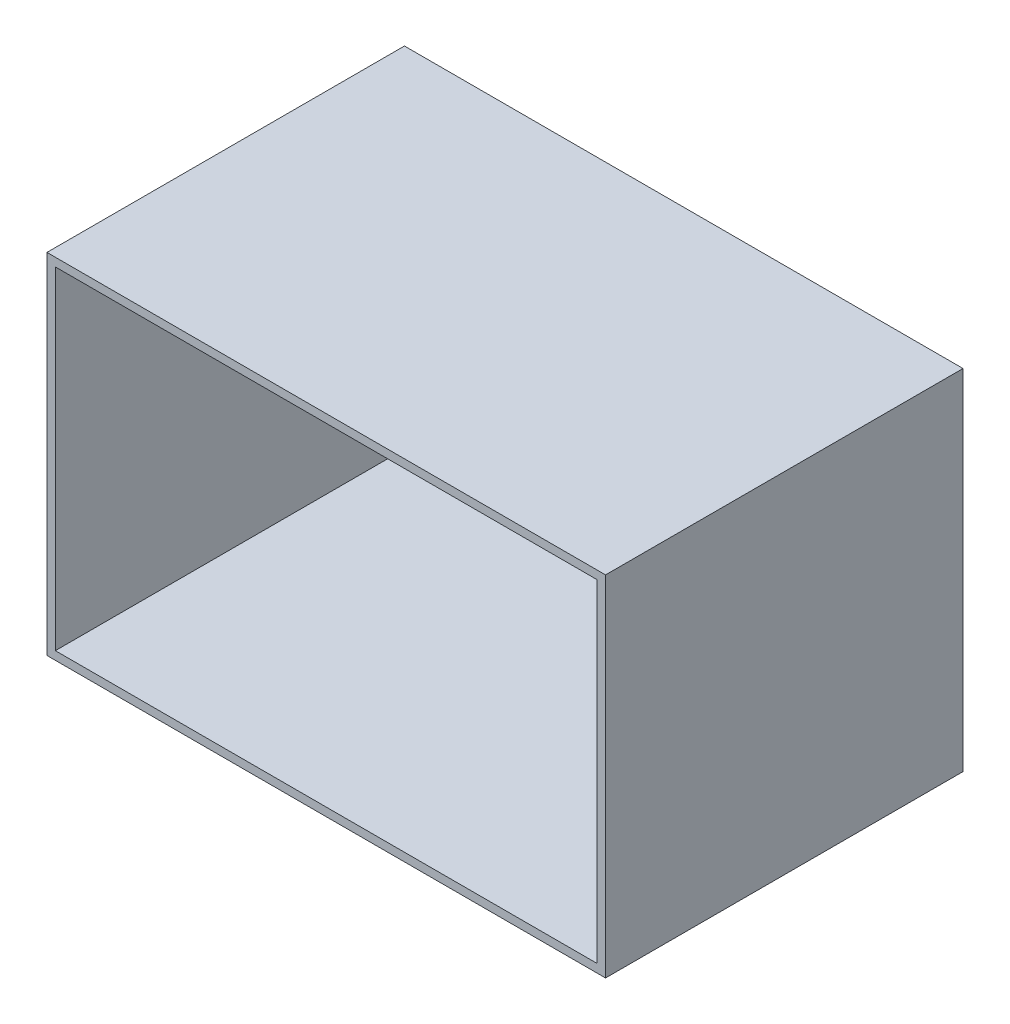
ISO-10303-21;
HEADER;
FILE_DESCRIPTION(('STEP AP214'),'2;1');
FILE_NAME('part.step','',(''),(''),'','','');
FILE_SCHEMA(('AUTOMOTIVE_DESIGN { 1 0 10303 214 1 1 1 1 }'));
ENDSEC;
DATA;
#1=APPLICATION_CONTEXT('core data for automotive mechanical design processes');
#2=APPLICATION_PROTOCOL_DEFINITION('international standard','automotive_design',2000,#1);
#3=PRODUCT_CONTEXT('',#1,'mechanical');
#4=PRODUCT('Part','Part','',(#3));
#5=PRODUCT_RELATED_PRODUCT_CATEGORY('part','',(#4));
#6=PRODUCT_DEFINITION_FORMATION('','',#4);
#7=PRODUCT_DEFINITION_CONTEXT('part definition',#1,'design');
#8=PRODUCT_DEFINITION('design','',#6,#7);
#9=PRODUCT_DEFINITION_SHAPE('','',#8);
#10=(LENGTH_UNIT() NAMED_UNIT(*) SI_UNIT(.MILLI.,.METRE.));
#11=(NAMED_UNIT(*) PLANE_ANGLE_UNIT() SI_UNIT($,.RADIAN.));
#12=(NAMED_UNIT(*) SI_UNIT($,.STERADIAN.) SOLID_ANGLE_UNIT());
#13=UNCERTAINTY_MEASURE_WITH_UNIT(LENGTH_MEASURE(1.E-05),#10,'distance_accuracy_value','');
#14=(GEOMETRIC_REPRESENTATION_CONTEXT(3) GLOBAL_UNCERTAINTY_ASSIGNED_CONTEXT((#13)) GLOBAL_UNIT_ASSIGNED_CONTEXT((#10,
#11,#12)) REPRESENTATION_CONTEXT('',''));
#15=CARTESIAN_POINT('',(0.,0.,0.));
#16=DIRECTION('',(0.,0.,1.));
#17=DIRECTION('',(1.,0.,0.));
#18=AXIS2_PLACEMENT_3D('',#15,#16,#17);
#19=CARTESIAN_POINT('',(200.,125.,6.));
#20=DIRECTION('',(-1.,0.,0.));
#21=DIRECTION('',(0.,-1.,0.));
#22=AXIS2_PLACEMENT_3D('',#19,#20,#21);
#23=PLANE('',#22);
#24=DIRECTION('',(0.,1.,0.));
#25=VECTOR('',#24,1.);
#26=CARTESIAN_POINT('',(200.,125.,0.));
#27=LINE('',#26,#25);
#28=CARTESIAN_POINT('',(200.,-125.,0.));
#29=VERTEX_POINT('',#28);
#30=CARTESIAN_POINT('',(200.,125.,0.));
#31=VERTEX_POINT('',#30);
#32=EDGE_CURVE('E176',#29,#31,#27,.T.);
#33=ORIENTED_EDGE('',*,*,#32,.T.);
#34=DIRECTION('',(0.,0.,-1.));
#35=VECTOR('',#34,1.);
#36=CARTESIAN_POINT('',(200.,125.,6.));
#37=LINE('',#36,#35);
#38=CARTESIAN_POINT('',(200.,125.,256.));
#39=VERTEX_POINT('',#38);
#40=EDGE_CURVE('E11',#39,#31,#37,.T.);
#41=ORIENTED_EDGE('',*,*,#40,.F.);
#42=DIRECTION('',(0.,1.,0.));
#43=VECTOR('',#42,1.);
#44=CARTESIAN_POINT('',(200.,-125.,256.));
#45=LINE('',#44,#43);
#46=CARTESIAN_POINT('',(200.,-125.,256.));
#47=VERTEX_POINT('',#46);
#48=EDGE_CURVE('E164',#47,#39,#45,.T.);
#49=ORIENTED_EDGE('',*,*,#48,.F.);
#50=DIRECTION('',(0.,0.,-1.));
#51=VECTOR('',#50,1.);
#52=CARTESIAN_POINT('',(200.,-125.,6.));
#53=LINE('',#52,#51);
#54=EDGE_CURVE('E189',#47,#29,#53,.T.);
#55=ORIENTED_EDGE('',*,*,#54,.T.);
#56=EDGE_LOOP('',(#33,#41,#49,#55));
#57=FACE_BOUND('',#56,.T.);
#58=ADVANCED_FACE('F48',(#57),#23,.F.);
#59=CARTESIAN_POINT('',(-200.,125.,6.));
#60=DIRECTION('',(0.,-1.,0.));
#61=DIRECTION('',(0.,0.,-1.));
#62=AXIS2_PLACEMENT_3D('',#59,#60,#61);
#63=PLANE('',#62);
#64=DIRECTION('',(-1.,0.,0.));
#65=VECTOR('',#64,1.);
#66=CARTESIAN_POINT('',(-200.,125.,0.));
#67=LINE('',#66,#65);
#68=CARTESIAN_POINT('',(-200.,125.,0.));
#69=VERTEX_POINT('',#68);
#70=EDGE_CURVE('E180',#31,#69,#67,.T.);
#71=ORIENTED_EDGE('',*,*,#70,.T.);
#72=DIRECTION('',(0.,0.,-1.));
#73=VECTOR('',#72,1.);
#74=CARTESIAN_POINT('',(-200.,125.,6.));
#75=LINE('',#74,#73);
#76=CARTESIAN_POINT('',(-200.,125.,256.));
#77=VERTEX_POINT('',#76);
#78=EDGE_CURVE('E56',#77,#69,#75,.T.);
#79=ORIENTED_EDGE('',*,*,#78,.F.);
#80=DIRECTION('',(-1.,0.,0.));
#81=VECTOR('',#80,1.);
#82=CARTESIAN_POINT('',(200.,125.,256.));
#83=LINE('',#82,#81);
#84=EDGE_CURVE('E168',#39,#77,#83,.T.);
#85=ORIENTED_EDGE('',*,*,#84,.F.);
#86=ORIENTED_EDGE('',*,*,#40,.T.);
#87=EDGE_LOOP('',(#71,#79,#85,#86));
#88=FACE_BOUND('',#87,.T.);
#89=ADVANCED_FACE('F214',(#88),#63,.F.);
#90=CARTESIAN_POINT('',(-200.,125.,6.));
#91=DIRECTION('',(1.,0.,0.));
#92=DIRECTION('',(0.,1.,0.));
#93=AXIS2_PLACEMENT_3D('',#90,#91,#92);
#94=PLANE('',#93);
#95=DIRECTION('',(0.,-1.,0.));
#96=VECTOR('',#95,1.);
#97=CARTESIAN_POINT('',(-200.,125.,0.));
#98=LINE('',#97,#96);
#99=CARTESIAN_POINT('',(-200.,-125.,0.));
#100=VERTEX_POINT('',#99);
#101=EDGE_CURVE('E183',#69,#100,#98,.T.);
#102=ORIENTED_EDGE('',*,*,#101,.T.);
#103=DIRECTION('',(0.,0.,-1.));
#104=VECTOR('',#103,1.);
#105=CARTESIAN_POINT('',(-200.,-125.,6.));
#106=LINE('',#105,#104);
#107=CARTESIAN_POINT('',(-200.,-125.,256.));
#108=VERTEX_POINT('',#107);
#109=EDGE_CURVE('E193',#108,#100,#106,.T.);
#110=ORIENTED_EDGE('',*,*,#109,.F.);
#111=DIRECTION('',(0.,-1.,0.));
#112=VECTOR('',#111,1.);
#113=CARTESIAN_POINT('',(-200.,125.,256.));
#114=LINE('',#113,#112);
#115=EDGE_CURVE('E172',#77,#108,#114,.T.);
#116=ORIENTED_EDGE('',*,*,#115,.F.);
#117=ORIENTED_EDGE('',*,*,#78,.T.);
#118=EDGE_LOOP('',(#102,#110,#116,#117));
#119=FACE_BOUND('',#118,.T.);
#120=ADVANCED_FACE('F201',(#119),#94,.F.);
#121=CARTESIAN_POINT('',(-200.,-125.,6.));
#122=DIRECTION('',(0.,1.,0.));
#123=DIRECTION('',(0.,0.,1.));
#124=AXIS2_PLACEMENT_3D('',#121,#122,#123);
#125=PLANE('',#124);
#126=DIRECTION('',(1.,0.,0.));
#127=VECTOR('',#126,1.);
#128=CARTESIAN_POINT('',(-200.,-125.,0.));
#129=LINE('',#128,#127);
#130=EDGE_CURVE('E186',#100,#29,#129,.T.);
#131=ORIENTED_EDGE('',*,*,#130,.T.);
#132=ORIENTED_EDGE('',*,*,#54,.F.);
#133=DIRECTION('',(1.,0.,0.));
#134=VECTOR('',#133,1.);
#135=CARTESIAN_POINT('',(-200.,-125.,256.));
#136=LINE('',#135,#134);
#137=EDGE_CURVE('E129',#108,#47,#136,.T.);
#138=ORIENTED_EDGE('',*,*,#137,.F.);
#139=ORIENTED_EDGE('',*,*,#109,.T.);
#140=EDGE_LOOP('',(#131,#132,#138,#139));
#141=FACE_BOUND('',#140,.T.);
#142=ADVANCED_FACE('F209',(#141),#125,.F.);
#143=CARTESIAN_POINT('',(0.,0.,0.));
#144=DIRECTION('',(0.,0.,1.));
#145=DIRECTION('',(1.,0.,0.));
#146=AXIS2_PLACEMENT_3D('',#143,#144,#145);
#147=PLANE('',#146);
#148=ORIENTED_EDGE('',*,*,#32,.F.);
#149=ORIENTED_EDGE('',*,*,#130,.F.);
#150=ORIENTED_EDGE('',*,*,#101,.F.);
#151=ORIENTED_EDGE('',*,*,#70,.F.);
#152=EDGE_LOOP('',(#148,#149,#150,#151));
#153=FACE_BOUND('',#152,.T.);
#154=ADVANCED_FACE('F207',(#153),#147,.F.);
#155=CARTESIAN_POINT('',(0.,0.,256.));
#156=DIRECTION('',(0.,0.,1.));
#157=DIRECTION('',(1.,0.,0.));
#158=AXIS2_PLACEMENT_3D('',#155,#156,#157);
#159=PLANE('',#158);
#160=ORIENTED_EDGE('',*,*,#137,.T.);
#161=ORIENTED_EDGE('',*,*,#48,.T.);
#162=ORIENTED_EDGE('',*,*,#84,.T.);
#163=ORIENTED_EDGE('',*,*,#115,.T.);
#164=EDGE_LOOP('',(#160,#161,#162,#163));
#165=FACE_BOUND('',#164,.T.);
#166=DIRECTION('',(-1.,0.,0.));
#167=VECTOR('',#166,1.);
#168=CARTESIAN_POINT('',(-194.,119.,256.));
#169=LINE('',#168,#167);
#170=CARTESIAN_POINT('',(194.,119.,256.));
#171=VERTEX_POINT('',#170);
#172=CARTESIAN_POINT('',(-194.,119.,256.));
#173=VERTEX_POINT('',#172);
#174=EDGE_CURVE('E122',#171,#173,#169,.T.);
#175=ORIENTED_EDGE('',*,*,#174,.F.);
#176=DIRECTION('',(0.,1.,0.));
#177=VECTOR('',#176,1.);
#178=CARTESIAN_POINT('',(194.,119.,256.));
#179=LINE('',#178,#177);
#180=CARTESIAN_POINT('',(194.,-119.,256.));
#181=VERTEX_POINT('',#180);
#182=EDGE_CURVE('E112',#181,#171,#179,.T.);
#183=ORIENTED_EDGE('',*,*,#182,.F.);
#184=DIRECTION('',(1.,0.,0.));
#185=VECTOR('',#184,1.);
#186=CARTESIAN_POINT('',(-194.,-119.,256.));
#187=LINE('',#186,#185);
#188=CARTESIAN_POINT('',(-194.,-119.,256.));
#189=VERTEX_POINT('',#188);
#190=EDGE_CURVE('E139',#189,#181,#187,.T.);
#191=ORIENTED_EDGE('',*,*,#190,.F.);
#192=DIRECTION('',(0.,-1.,0.));
#193=VECTOR('',#192,1.);
#194=CARTESIAN_POINT('',(-194.,119.,256.));
#195=LINE('',#194,#193);
#196=EDGE_CURVE('E135',#173,#189,#195,.T.);
#197=ORIENTED_EDGE('',*,*,#196,.F.);
#198=EDGE_LOOP('',(#175,#183,#191,#197));
#199=FACE_BOUND('',#198,.T.);
#200=ADVANCED_FACE('F133',(#165,#199),#159,.T.);
#201=CARTESIAN_POINT('',(194.,119.,256.));
#202=DIRECTION('',(-1.,0.,0.));
#203=DIRECTION('',(0.,0.,1.));
#204=AXIS2_PLACEMENT_3D('',#201,#202,#203);
#205=PLANE('',#204);
#206=DIRECTION('',(0.,1.,0.));
#207=VECTOR('',#206,1.);
#208=CARTESIAN_POINT('',(194.,119.,6.));
#209=LINE('',#208,#207);
#210=CARTESIAN_POINT('',(194.,-119.,6.));
#211=VERTEX_POINT('',#210);
#212=CARTESIAN_POINT('',(194.,119.,6.));
#213=VERTEX_POINT('',#212);
#214=EDGE_CURVE('E63',#211,#213,#209,.T.);
#215=ORIENTED_EDGE('',*,*,#214,.F.);
#216=DIRECTION('',(0.,0.,-1.));
#217=VECTOR('',#216,1.);
#218=CARTESIAN_POINT('',(194.,-119.,256.));
#219=LINE('',#218,#217);
#220=EDGE_CURVE('E117',#181,#211,#219,.T.);
#221=ORIENTED_EDGE('',*,*,#220,.F.);
#222=ORIENTED_EDGE('',*,*,#182,.T.);
#223=DIRECTION('',(0.,0.,-1.));
#224=VECTOR('',#223,1.);
#225=CARTESIAN_POINT('',(194.,119.,256.));
#226=LINE('',#225,#224);
#227=EDGE_CURVE('E115',#171,#213,#226,.T.);
#228=ORIENTED_EDGE('',*,*,#227,.T.);
#229=EDGE_LOOP('',(#215,#221,#222,#228));
#230=FACE_BOUND('',#229,.T.);
#231=ADVANCED_FACE('F114',(#230),#205,.T.);
#232=CARTESIAN_POINT('',(-194.,119.,256.));
#233=DIRECTION('',(0.,-1.,0.));
#234=DIRECTION('',(0.,0.,-1.));
#235=AXIS2_PLACEMENT_3D('',#232,#233,#234);
#236=PLANE('',#235);
#237=DIRECTION('',(-1.,0.,0.));
#238=VECTOR('',#237,1.);
#239=CARTESIAN_POINT('',(-194.,119.,6.));
#240=LINE('',#239,#238);
#241=CARTESIAN_POINT('',(-194.,119.,6.));
#242=VERTEX_POINT('',#241);
#243=EDGE_CURVE('E67',#213,#242,#240,.T.);
#244=ORIENTED_EDGE('',*,*,#243,.F.);
#245=ORIENTED_EDGE('',*,*,#227,.F.);
#246=ORIENTED_EDGE('',*,*,#174,.T.);
#247=DIRECTION('',(0.,0.,-1.));
#248=VECTOR('',#247,1.);
#249=CARTESIAN_POINT('',(-194.,119.,256.));
#250=LINE('',#249,#248);
#251=EDGE_CURVE('E130',#173,#242,#250,.T.);
#252=ORIENTED_EDGE('',*,*,#251,.T.);
#253=EDGE_LOOP('',(#244,#245,#246,#252));
#254=FACE_BOUND('',#253,.T.);
#255=ADVANCED_FACE('F126',(#254),#236,.T.);
#256=CARTESIAN_POINT('',(-194.,119.,256.));
#257=DIRECTION('',(1.,0.,0.));
#258=DIRECTION('',(0.,0.,-1.));
#259=AXIS2_PLACEMENT_3D('',#256,#257,#258);
#260=PLANE('',#259);
#261=DIRECTION('',(0.,-1.,0.));
#262=VECTOR('',#261,1.);
#263=CARTESIAN_POINT('',(-194.,119.,6.));
#264=LINE('',#263,#262);
#265=CARTESIAN_POINT('',(-194.,-119.,6.));
#266=VERTEX_POINT('',#265);
#267=EDGE_CURVE('E148',#242,#266,#264,.T.);
#268=ORIENTED_EDGE('',*,*,#267,.F.);
#269=ORIENTED_EDGE('',*,*,#251,.F.);
#270=ORIENTED_EDGE('',*,*,#196,.T.);
#271=DIRECTION('',(0.,0.,-1.));
#272=VECTOR('',#271,1.);
#273=CARTESIAN_POINT('',(-194.,-119.,256.));
#274=LINE('',#273,#272);
#275=EDGE_CURVE('E155',#189,#266,#274,.T.);
#276=ORIENTED_EDGE('',*,*,#275,.T.);
#277=EDGE_LOOP('',(#268,#269,#270,#276));
#278=FACE_BOUND('',#277,.T.);
#279=ADVANCED_FACE('F236',(#278),#260,.T.);
#280=CARTESIAN_POINT('',(-194.,-119.,256.));
#281=DIRECTION('',(0.,1.,0.));
#282=DIRECTION('',(0.,0.,1.));
#283=AXIS2_PLACEMENT_3D('',#280,#281,#282);
#284=PLANE('',#283);
#285=DIRECTION('',(1.,0.,0.));
#286=VECTOR('',#285,1.);
#287=CARTESIAN_POINT('',(-194.,-119.,6.));
#288=LINE('',#287,#286);
#289=EDGE_CURVE('E123',#266,#211,#288,.T.);
#290=ORIENTED_EDGE('',*,*,#289,.F.);
#291=ORIENTED_EDGE('',*,*,#275,.F.);
#292=ORIENTED_EDGE('',*,*,#190,.T.);
#293=ORIENTED_EDGE('',*,*,#220,.T.);
#294=EDGE_LOOP('',(#290,#291,#292,#293));
#295=FACE_BOUND('',#294,.T.);
#296=ADVANCED_FACE('F229',(#295),#284,.T.);
#297=CARTESIAN_POINT('',(0.,0.,6.));
#298=DIRECTION('',(0.,0.,1.));
#299=DIRECTION('',(1.,0.,0.));
#300=AXIS2_PLACEMENT_3D('',#297,#298,#299);
#301=PLANE('',#300);
#302=ORIENTED_EDGE('',*,*,#214,.T.);
#303=ORIENTED_EDGE('',*,*,#243,.T.);
#304=ORIENTED_EDGE('',*,*,#267,.T.);
#305=ORIENTED_EDGE('',*,*,#289,.T.);
#306=EDGE_LOOP('',(#302,#303,#304,#305));
#307=FACE_BOUND('',#306,.T.);
#308=ADVANCED_FACE('F226',(#307),#301,.T.);
#309=CLOSED_SHELL('',(#58,#89,#120,#142,#154,#200,#231,#255,#279,#296,#308));
#310=MANIFOLD_SOLID_BREP('B2',#309);
#311=ADVANCED_BREP_SHAPE_REPRESENTATION('',(#18,#310),#14);
#312=SHAPE_DEFINITION_REPRESENTATION(#9,#311);
ENDSEC;
END-ISO-10303-21;
